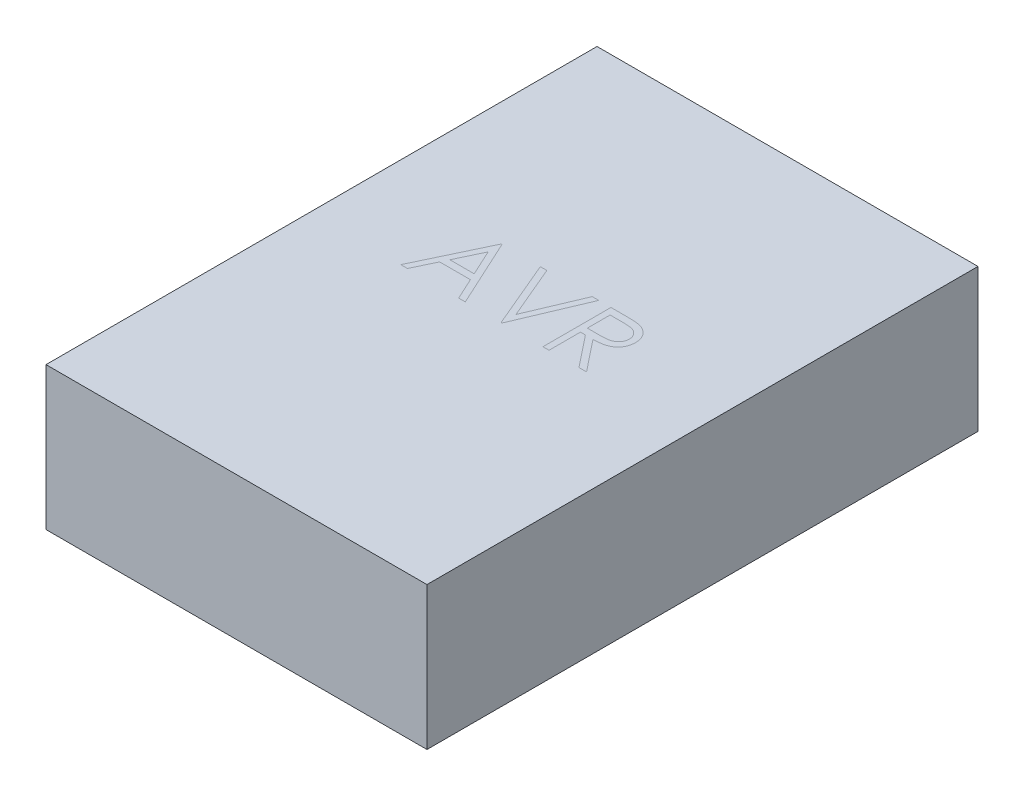
ISO-10303-21;
HEADER;
FILE_DESCRIPTION(('STEP AP214'),'2;1');
FILE_NAME('part.step','',(''),(''),'','','');
FILE_SCHEMA(('AUTOMOTIVE_DESIGN { 1 0 10303 214 1 1 1 1 }'));
ENDSEC;
DATA;
#1=APPLICATION_CONTEXT('core data for automotive mechanical design processes');
#2=APPLICATION_PROTOCOL_DEFINITION('international standard','automotive_design',2000,#1);
#3=PRODUCT_CONTEXT('',#1,'mechanical');
#4=PRODUCT('Part','Part','',(#3));
#5=PRODUCT_RELATED_PRODUCT_CATEGORY('part','',(#4));
#6=PRODUCT_DEFINITION_FORMATION('','',#4);
#7=PRODUCT_DEFINITION_CONTEXT('part definition',#1,'design');
#8=PRODUCT_DEFINITION('design','',#6,#7);
#9=PRODUCT_DEFINITION_SHAPE('','',#8);
#10=(LENGTH_UNIT() NAMED_UNIT(*) SI_UNIT(.MILLI.,.METRE.));
#11=(NAMED_UNIT(*) PLANE_ANGLE_UNIT() SI_UNIT($,.RADIAN.));
#12=(NAMED_UNIT(*) SI_UNIT($,.STERADIAN.) SOLID_ANGLE_UNIT());
#13=UNCERTAINTY_MEASURE_WITH_UNIT(LENGTH_MEASURE(1.E-05),#10,'distance_accuracy_value','');
#14=(GEOMETRIC_REPRESENTATION_CONTEXT(3) GLOBAL_UNCERTAINTY_ASSIGNED_CONTEXT((#13)) GLOBAL_UNIT_ASSIGNED_CONTEXT((#10,
#11,#12)) REPRESENTATION_CONTEXT('',''));
#15=CARTESIAN_POINT('',(0.,0.,0.));
#16=DIRECTION('',(0.,0.,1.));
#17=DIRECTION('',(1.,0.,0.));
#18=AXIS2_PLACEMENT_3D('',#15,#16,#17);
#19=CARTESIAN_POINT('',(0.,105.,0.));
#20=DIRECTION('',(0.,1.,0.));
#21=DIRECTION('',(0.,0.,1.));
#22=AXIS2_PLACEMENT_3D('',#19,#20,#21);
#23=PLANE('',#22);
#24=DIRECTION('',(-1.,0.,0.));
#25=VECTOR('',#24,1.);
#26=CARTESIAN_POINT('',(0.,105.,-41.5071527558936));
#27=LINE('',#26,#25);
#28=CARTESIAN_POINT('',(41.2358151045253,105.,-41.5071527558936));
#29=VERTEX_POINT('',#28);
#30=CARTESIAN_POINT('',(31.2298054891407,105.,-41.5071527558936));
#31=VERTEX_POINT('',#30);
#32=EDGE_CURVE('E321',#29,#31,#27,.T.);
#33=ORIENTED_EDGE('',*,*,#32,.T.);
#34=DIRECTION('',(0.,0.,1.));
#35=VECTOR('',#34,1.);
#36=CARTESIAN_POINT('',(31.2298054891407,105.,0.));
#37=LINE('',#36,#35);
#38=CARTESIAN_POINT('',(31.2298054891407,105.,8.49284724410642));
#39=VERTEX_POINT('',#38);
#40=EDGE_CURVE('E328',#31,#39,#37,.T.);
#41=ORIENTED_EDGE('',*,*,#40,.T.);
#42=DIRECTION('',(1.,0.,0.));
#43=VECTOR('',#42,1.);
#44=CARTESIAN_POINT('',(0.,105.,8.49284724410642));
#45=LINE('',#44,#43);
#46=CARTESIAN_POINT('',(35.7169849763202,105.,8.49284724410642));
#47=VERTEX_POINT('',#46);
#48=EDGE_CURVE('E273',#39,#47,#45,.T.);
#49=ORIENTED_EDGE('',*,*,#48,.T.);
#50=DIRECTION('',(0.,0.,-1.));
#51=VECTOR('',#50,1.);
#52=CARTESIAN_POINT('',(35.7169849763202,105.,0.));
#53=LINE('',#52,#51);
#54=CARTESIAN_POINT('',(35.7169849763202,105.,-14.5840758328167));
#55=VERTEX_POINT('',#54);
#56=EDGE_CURVE('E277',#47,#55,#53,.T.);
#57=ORIENTED_EDGE('',*,*,#56,.T.);
#58=DIRECTION('',(1.,0.,0.));
#59=VECTOR('',#58,1.);
#60=CARTESIAN_POINT('',(0.,105.,-14.5840758328167));
#61=LINE('',#60,#59);
#62=CARTESIAN_POINT('',(39.3628183096535,105.,-14.5840758328167));
#63=VERTEX_POINT('',#62);
#64=EDGE_CURVE('E281',#55,#63,#61,.T.);
#65=ORIENTED_EDGE('',*,*,#64,.T.);
#66=DIRECTION('',(0.622788232243938,0.,0.782390450976027));
#67=VECTOR('',#66,1.);
#68=CARTESIAN_POINT('',(31.2016404087046,105.,-24.8367224433872));
#69=LINE('',#68,#67);
#70=CARTESIAN_POINT('',(57.7322093352946,105.,8.49284724410642));
#71=VERTEX_POINT('',#70);
#72=EDGE_CURVE('E285',#63,#71,#69,.T.);
#73=ORIENTED_EDGE('',*,*,#72,.T.);
#74=DIRECTION('',(1.,0.,0.));
#75=VECTOR('',#74,1.);
#76=CARTESIAN_POINT('',(0.,105.,8.49284724410642));
#77=LINE('',#76,#75);
#78=CARTESIAN_POINT('',(63.2810875404228,105.,8.49284724410642));
#79=VERTEX_POINT('',#78);
#80=EDGE_CURVE('E289',#71,#79,#77,.T.);
#81=ORIENTED_EDGE('',*,*,#80,.T.);
#82=DIRECTION('',(-0.622788232243938,0.,-0.782390450976027));
#83=VECTOR('',#82,1.);
#84=CARTESIAN_POINT('',(34.5983019576757,105.,-27.5404886242956));
#85=LINE('',#84,#83);
#86=CARTESIAN_POINT('',(44.9116965147818,105.,-14.5840758328167));
#87=VERTEX_POINT('',#86);
#88=EDGE_CURVE('E293',#79,#87,#85,.T.);
#89=ORIENTED_EDGE('',*,*,#88,.T.);
#90=CARTESIAN_POINT('',(62.6400618993972,105.,-28.1357585251244));
#91=CARTESIAN_POINT('',(62.6190762121329,105.,-27.469542744968));
#92=CARTESIAN_POINT('',(62.5781277008523,105.,-26.16958320371));
#93=CARTESIAN_POINT('',(62.1963405054234,105.,-24.2829991835847));
#94=CARTESIAN_POINT('',(61.5709616521555,105.,-22.5231518315783));
#95=CARTESIAN_POINT('',(60.7092003805939,105.,-20.8922570042145));
#96=CARTESIAN_POINT('',(59.6117792989727,105.,-19.4221049276412));
#97=CARTESIAN_POINT('',(58.2928537117819,105.,-18.1308127090144));
#98=CARTESIAN_POINT('',(56.751687833358,105.,-17.0502425291456));
#99=CARTESIAN_POINT('',(55.3169833199411,105.,-16.3009167476955));
#100=CARTESIAN_POINT('',(54.0496376099892,105.,-15.8210180530562));
#101=CARTESIAN_POINT('',(53.0063045701602,105.,-15.4833557836413));
#102=CARTESIAN_POINT('',(51.8682048916484,105.,-15.2224705653973));
#103=CARTESIAN_POINT('',(50.6462429687073,105.,-14.9887543972461));
#104=CARTESIAN_POINT('',(49.3353336045344,105.,-14.8123016199386));
#105=CARTESIAN_POINT('',(47.9386187561172,105.,-14.6830645560907));
#106=CARTESIAN_POINT('',(46.4551023042588,105.,-14.6022924318295));
#107=CARTESIAN_POINT('',(45.4359727420711,105.,-14.590263790559));
#108=CARTESIAN_POINT('',(44.9116965147817,105.,-14.5840758328167));
#109=B_SPLINE_CURVE_WITH_KNOTS('',3,(#90,#91,#92,#93,#94,#95,#96,#97,#98,#99,#100,#101,#102,
#103,#104,#105,#106,#107,#108),.UNSPECIFIED.,.F.,.F.,(4,1,1,1,1,1,1,1,1,1,1,1,1,1,1,1,4),(0.,
0.0787802355821393,0.153720644208585,0.226713530308781,0.299191166065937,0.371189996837668,
0.44300641435341,0.516689173294881,0.593217216623412,0.633872917807845,0.67698914228998,
0.722899506325827,0.771958610506145,0.824211323334835,0.879378650627203,0.937948119330418,1.),.UNSPECIFIED.);
#110=CARTESIAN_POINT('',(62.6400618993972,105.,-28.1357585251244));
#111=VERTEX_POINT('',#110);
#112=EDGE_CURVE('E297',#87,#111,#109,.F.);
#113=ORIENTED_EDGE('',*,*,#112,.T.);
#114=CARTESIAN_POINT('',(52.5639401045253,105.,-40.8260630123038));
#115=CARTESIAN_POINT('',(52.9297490207659,105.,-40.7356806499386));
#116=CARTESIAN_POINT('',(53.6535631560764,105.,-40.5568440263399));
#117=CARTESIAN_POINT('',(54.6957069566463,105.,-40.1788497288592));
#118=CARTESIAN_POINT('',(55.6887687273854,105.,-39.7414265199349));
#119=CARTESIAN_POINT('',(56.6286233605528,105.,-39.2276590868195));
#120=CARTESIAN_POINT('',(57.5105632347016,105.,-38.6337336629263));
#121=CARTESIAN_POINT('',(58.3436819603397,105.,-37.9699033424242));
#122=CARTESIAN_POINT('',(59.131760008625,105.,-37.239800402846));
#123=CARTESIAN_POINT('',(59.8429261540587,105.,-36.425016952808));
#124=CARTESIAN_POINT('',(60.5134840354094,105.,-35.5702096716652));
#125=CARTESIAN_POINT('',(61.0790358425606,105.,-34.6458702882198));
#126=CARTESIAN_POINT('',(61.5665569814533,105.,-33.6792770378767));
#127=CARTESIAN_POINT('',(61.9547072243125,105.,-32.6605996413698));
#128=CARTESIAN_POINT('',(62.2672497025004,105.,-31.5997171861895));
#129=CARTESIAN_POINT('',(62.4876245506569,105.,-30.4870200900866));
#130=CARTESIAN_POINT('',(62.6197843739541,105.,-29.3275775888878));
#131=CARTESIAN_POINT('',(62.6332394532901,105.,-28.5367503204362));
#132=CARTESIAN_POINT('',(62.6400618993971,105.,-28.1357585251244));
#133=B_SPLINE_CURVE_WITH_KNOTS('',3,(#114,#115,#116,#117,#118,#119,#120,#121,#122,#123,#124,
#125,#126,#127,#128,#129,#130,#131,#132),.UNSPECIFIED.,.F.,.F.,(4,1,1,1,1,1,1,1,1,1,1,1,1,1,1,1,
4),(0.,0.06421684263143,0.127063765693128,0.188744538347829,0.249132102835042,0.309452532710628,
0.369826676247682,0.430650141838468,0.492351931879469,0.554072106262517,0.615689783744975,
0.676797702506538,0.738439048246942,0.801316910064893,0.865184511711541,0.931641324419076,1.),.UNSPECIFIED.);
#134=CARTESIAN_POINT('',(52.5639401045253,105.,-40.8260630123038));
#135=VERTEX_POINT('',#134);
#136=EDGE_CURVE('E303',#111,#135,#133,.F.);
#137=ORIENTED_EDGE('',*,*,#136,.T.);
#138=CARTESIAN_POINT('',(41.2358151045253,105.,-41.5071527558936));
#139=CARTESIAN_POINT('',(41.9035455118622,105.,-41.5049300989216));
#140=CARTESIAN_POINT('',(43.1856618605631,105.,-41.5006623513248));
#141=CARTESIAN_POINT('',(45.0224228657008,105.,-41.4768657383513));
#142=CARTESIAN_POINT('',(46.6913813942749,105.,-41.4086606568051));
#143=CARTESIAN_POINT('',(48.1916648130912,105.,-41.349966607132));
#144=CARTESIAN_POINT('',(49.523245598467,105.,-41.2429388739442));
#145=CARTESIAN_POINT('',(50.6902068948663,105.,-41.1406439150898));
#146=CARTESIAN_POINT('',(51.6871740020264,105.,-41.0067344753906));
#147=CARTESIAN_POINT('',(52.2906861634918,105.,-40.8823712901673));
#148=CARTESIAN_POINT('',(52.5639401045253,105.,-40.8260630123038));
#149=B_SPLINE_CURVE_WITH_KNOTS('',3,(#138,#139,#140,#141,#142,#143,#144,#145,#146,#147,#148),
.UNSPECIFIED.,.F.,.F.,(4,1,1,1,1,1,1,1,4),(0.,0.176257754817801,0.338434413880475,
0.484822050787837,0.617157578266332,0.734698360612476,0.83738518383236,0.926372420929583,1.),.UNSPECIFIED.);
#150=EDGE_CURVE('E312',#135,#29,#149,.F.);
#151=ORIENTED_EDGE('',*,*,#150,.T.);
#152=EDGE_LOOP('',(#33,#41,#49,#57,#65,#73,#81,#89,#113,#137,#151));
#153=FACE_BOUND('',#152,.T.);
#154=DIRECTION('',(0.,0.,-1.));
#155=VECTOR('',#154,1.);
#156=CARTESIAN_POINT('',(35.7169849763202,105.,0.));
#157=LINE('',#156,#155);
#158=CARTESIAN_POINT('',(35.7169849763202,105.,-19.7122809610218));
#159=VERTEX_POINT('',#158);
#160=CARTESIAN_POINT('',(35.7169849763202,105.,-36.3789476276885));
#161=VERTEX_POINT('',#160);
#162=EDGE_CURVE('E45',#159,#161,#157,.T.);
#163=ORIENTED_EDGE('',*,*,#162,.T.);
#164=DIRECTION('',(1.,0.,0.));
#165=VECTOR('',#164,1.);
#166=CARTESIAN_POINT('',(0.,105.,-36.3789476276885));
#167=LINE('',#166,#165);
#168=CARTESIAN_POINT('',(45.0919849763202,105.,-36.3789476276885));
#169=VERTEX_POINT('',#168);
#170=EDGE_CURVE('E11',#161,#169,#167,.T.);
#171=ORIENTED_EDGE('',*,*,#170,.T.);
#172=CARTESIAN_POINT('',(58.1528824122176,105.,-28.1457745507654));
#173=CARTESIAN_POINT('',(58.1357092538106,105.,-28.5478684611895));
#174=CARTESIAN_POINT('',(58.1016783201925,105.,-29.3446718708834));
#175=CARTESIAN_POINT('',(57.8238387698108,105.,-30.5111848749922));
#176=CARTESIAN_POINT('',(57.3539904647186,105.,-31.6121413054318));
#177=CARTESIAN_POINT('',(56.7208156372218,105.,-32.643062519599));
#178=CARTESIAN_POINT('',(55.9493991377572,105.,-33.5788587460902));
#179=CARTESIAN_POINT('',(55.0448589564054,105.,-34.3795323611977));
#180=CARTESIAN_POINT('',(54.0319275971186,105.,-35.0402389994562));
#181=CARTESIAN_POINT('',(53.0851961920918,105.,-35.46244443534));
#182=CARTESIAN_POINT('',(52.2389931564861,105.,-35.7212994817104));
#183=CARTESIAN_POINT('',(51.5042837273302,105.,-35.9034589647253));
#184=CARTESIAN_POINT('',(50.6741197599105,105.,-36.0498085208673));
#185=CARTESIAN_POINT('',(49.7444703511685,105.,-36.1670665333704));
#186=CARTESIAN_POINT('',(48.7193041970989,105.,-36.2678514512103));
#187=CARTESIAN_POINT('',(47.5934377529344,105.,-36.3357340034692));
#188=CARTESIAN_POINT('',(46.3743408920589,105.,-36.3759320621265));
#189=CARTESIAN_POINT('',(45.5293847321814,105.,-36.3779190461345));
#190=CARTESIAN_POINT('',(45.0919849763202,105.,-36.3789476276885));
#191=B_SPLINE_CURVE_WITH_KNOTS('',3,(#172,#173,#174,#175,#176,#177,#178,#179,#180,#181,#182,
#183,#184,#185,#186,#187,#188,#189,#190),.UNSPECIFIED.,.F.,.F.,(4,1,1,1,1,1,1,1,1,1,1,1,1,1,1,1,
4),(0.,0.068814295824309,0.136364824552215,0.204019353511246,0.273063738624611,0.34291331956149,
0.410965444138957,0.479168766513446,0.549308006509783,0.58765157641765,0.63064666876279,
0.678878785696649,0.731934299229583,0.791111422948047,0.855283189513077,0.925085938677385,1.),.UNSPECIFIED.);
#192=CARTESIAN_POINT('',(58.1528824122176,105.,-28.1457745507654));
#193=VERTEX_POINT('',#192);
#194=EDGE_CURVE('E331',#169,#193,#191,.F.);
#195=ORIENTED_EDGE('',*,*,#194,.T.);
#196=CARTESIAN_POINT('',(44.8716324122176,105.,-19.6421687815346));
#197=CARTESIAN_POINT('',(45.2990615396727,105.,-19.6419796864752));
#198=CARTESIAN_POINT('',(46.1275409270928,105.,-19.6416131663929));
#199=CARTESIAN_POINT('',(47.3261218529697,105.,-19.6986671127294));
#200=CARTESIAN_POINT('',(48.4421234485639,105.,-19.7635716590576));
#201=CARTESIAN_POINT('',(49.4712770508842,105.,-19.8628480238682));
#202=CARTESIAN_POINT('',(50.4140424126837,105.,-19.9907919056648));
#203=CARTESIAN_POINT('',(51.2699483158494,105.,-20.1508345376451));
#204=CARTESIAN_POINT('',(52.0403919143743,105.,-20.3372925754578));
#205=CARTESIAN_POINT('',(52.93894246327,105.,-20.6258872298861));
#206=CARTESIAN_POINT('',(53.9423214826546,105.,-21.0831160622469));
#207=CARTESIAN_POINT('',(55.0327709094698,105.,-21.7483374721689));
#208=CARTESIAN_POINT('',(55.9613757344774,105.,-22.5850391745616));
#209=CARTESIAN_POINT('',(56.7459166245482,105.,-23.541802832196));
#210=CARTESIAN_POINT('',(57.3763370741956,105.,-24.5937492441627));
#211=CARTESIAN_POINT('',(57.8207949932604,105.,-25.728268804394));
#212=CARTESIAN_POINT('',(58.1028298831473,105.,-26.9167202045027));
#213=CARTESIAN_POINT('',(58.1360948181391,105.,-27.7335503165704));
#214=CARTESIAN_POINT('',(58.1528824122176,105.,-28.1457745507654));
#215=B_SPLINE_CURVE_WITH_KNOTS('',3,(#196,#197,#198,#199,#200,#201,#202,#203,#204,#205,#206,
#207,#208,#209,#210,#211,#212,#213,#214),.UNSPECIFIED.,.F.,.F.,(4,1,1,1,1,1,1,1,1,1,1,1,1,1,1,1,
4),(0.,0.0716681496796049,0.138913286274205,0.201184570026559,0.259124428290545,
0.312255041426236,0.36068150962311,0.405086143328644,0.44510165859071,0.51877778048826,
0.589461579033196,0.658462241985717,0.727283218368366,0.796322486904719,0.863174893207881,
0.930949380987856,1.),.UNSPECIFIED.);
#216=CARTESIAN_POINT('',(44.8716324122176,105.,-19.6421687815346));
#217=VERTEX_POINT('',#216);
#218=EDGE_CURVE('E337',#193,#217,#215,.F.);
#219=ORIENTED_EDGE('',*,*,#218,.T.);
#220=DIRECTION('',(-0.999970673881285,0.,-0.00765841872775599));
#221=VECTOR('',#220,1.);
#222=CARTESIAN_POINT('',(0.153055324829829,105.,-19.9846524134949));
#223=LINE('',#222,#221);
#224=EDGE_CURVE('E346',#217,#159,#223,.T.);
#225=ORIENTED_EDGE('',*,*,#224,.T.);
#226=EDGE_LOOP('',(#163,#171,#195,#219,#225));
#227=FACE_BOUND('',#226,.T.);
#228=ADVANCED_FACE('F36',(#153,#227),#23,.T.);
#229=ORIENTED_EDGE('',*,*,#170,.F.);
#230=ORIENTED_EDGE('',*,*,#162,.F.);
#231=ORIENTED_EDGE('',*,*,#224,.F.);
#232=ORIENTED_EDGE('',*,*,#218,.F.);
#233=ORIENTED_EDGE('',*,*,#194,.F.);
#234=EDGE_LOOP('',(#229,#230,#231,#232,#233));
#235=FACE_BOUND('',#234,.T.);
#236=ADVANCED_FACE('F355',(#235),#23,.T.);
#237=DIRECTION('',(-1.,0.,0.));
#238=VECTOR('',#237,1.);
#239=CARTESIAN_POINT('',(0.,105.,-41.5071527558936));
#240=LINE('',#239,#238);
#241=CARTESIAN_POINT('',(-15.8855791262439,105.,-41.5071527558936));
#242=VERTEX_POINT('',#241);
#243=CARTESIAN_POINT('',(-20.6932714339362,105.,-41.5071527558936));
#244=VERTEX_POINT('',#243);
#245=EDGE_CURVE('E266',#242,#244,#240,.T.);
#246=ORIENTED_EDGE('',*,*,#245,.T.);
#247=DIRECTION('',(0.389639990836698,0.,0.920967251068559));
#248=VECTOR('',#247,1.);
#249=CARTESIAN_POINT('',(-2.65697089229022,105.,1.12410306981509));
#250=LINE('',#249,#248);
#251=CARTESIAN_POINT('',(0.460574719909956,105.,8.49284724410642));
#252=VERTEX_POINT('',#251);
#253=EDGE_CURVE('E270',#244,#252,#250,.T.);
#254=ORIENTED_EDGE('',*,*,#253,.T.);
#255=DIRECTION('',(1.,0.,0.));
#256=VECTOR('',#255,1.);
#257=CARTESIAN_POINT('',(0.,105.,8.49284724410642));
#258=LINE('',#257,#256);
#259=CARTESIAN_POINT('',(1.1016003609356,105.,8.49284724410642));
#260=VERTEX_POINT('',#259);
#261=EDGE_CURVE('E246',#252,#260,#258,.T.);
#262=ORIENTED_EDGE('',*,*,#261,.T.);
#263=DIRECTION('',(0.389639990836698,0.,-0.920967251068559));
#264=VECTOR('',#263,1.);
#265=CARTESIAN_POINT('',(3.98197761079912,105.,1.68468283533809));
#266=LINE('',#265,#264);
#267=CARTESIAN_POINT('',(22.2554465147817,105.,-41.5071527558936));
#268=VERTEX_POINT('',#267);
#269=EDGE_CURVE('E250',#260,#268,#266,.T.);
#270=ORIENTED_EDGE('',*,*,#269,.T.);
#271=DIRECTION('',(-1.,0.,0.));
#272=VECTOR('',#271,1.);
#273=CARTESIAN_POINT('',(0.,105.,-41.5071527558936));
#274=LINE('',#273,#272);
#275=CARTESIAN_POINT('',(17.4377381814484,105.,-41.5071527558936));
#276=VERTEX_POINT('',#275);
#277=EDGE_CURVE('E254',#268,#276,#274,.T.);
#278=ORIENTED_EDGE('',*,*,#277,.T.);
#279=DIRECTION('',(-0.389815755430441,0.,0.920892869349196));
#280=VECTOR('',#279,1.);
#281=CARTESIAN_POINT('',(-0.112213888885631,105.,-0.0475003589686313));
#282=LINE('',#281,#280);
#283=CARTESIAN_POINT('',(0.771071514781743,105.,-2.13415596102179));
#284=VERTEX_POINT('',#283);
#285=EDGE_CURVE('E258',#276,#284,#282,.T.);
#286=ORIENTED_EDGE('',*,*,#285,.T.);
#287=DIRECTION('',(-0.389617061880413,0.,-0.920976951444321));
#288=VECTOR('',#287,1.);
#289=CARTESIAN_POINT('',(1.41981736473583,105.,-0.600650286836858));
#290=LINE('',#289,#288);
#291=EDGE_CURVE('E262',#284,#242,#290,.T.);
#292=ORIENTED_EDGE('',*,*,#291,.T.);
#293=EDGE_LOOP('',(#246,#254,#262,#270,#278,#286,#292));
#294=FACE_BOUND('',#293,.T.);
#295=ADVANCED_FACE('F357',(#294),#23,.T.);
#296=DIRECTION('',(-0.419058177461747,0.,-0.907959384500452));
#297=VECTOR('',#296,1.);
#298=CARTESIAN_POINT('',(-24.5183981660594,105.,11.3161837689505));
#299=LINE('',#298,#297);
#300=CARTESIAN_POINT('',(-25.8214765621413,105.,8.49284724410642));
#301=VERTEX_POINT('',#300);
#302=CARTESIAN_POINT('',(-48.8983996390644,105.,-41.5071527558936));
#303=VERTEX_POINT('',#302);
#304=EDGE_CURVE('E228',#301,#303,#299,.T.);
#305=ORIENTED_EDGE('',*,*,#304,.T.);
#306=DIRECTION('',(-1.,0.,0.));
#307=VECTOR('',#306,1.);
#308=CARTESIAN_POINT('',(0.,105.,-41.5071527558936));
#309=LINE('',#308,#307);
#310=CARTESIAN_POINT('',(-49.53942528009,105.,-41.5071527558936));
#311=VERTEX_POINT('',#310);
#312=EDGE_CURVE('E232',#303,#311,#309,.T.);
#313=ORIENTED_EDGE('',*,*,#312,.T.);
#314=DIRECTION('',(-0.428584206872173,0.,0.903501841514311));
#315=VECTOR('',#314,1.);
#316=CARTESIAN_POINT('',(-56.5124790363044,105.,-26.8072015941444));
#317=LINE('',#316,#315);
#318=CARTESIAN_POINT('',(-73.2573739980387,105.,8.49284724410642));
#319=VERTEX_POINT('',#318);
#320=EDGE_CURVE('E199',#311,#319,#317,.T.);
#321=ORIENTED_EDGE('',*,*,#320,.T.);
#322=DIRECTION('',(1.,0.,0.));
#323=VECTOR('',#322,1.);
#324=CARTESIAN_POINT('',(0.,105.,8.49284724410642));
#325=LINE('',#324,#323);
#326=CARTESIAN_POINT('',(-68.3495214339362,105.,8.49284724410642));
#327=VERTEX_POINT('',#326);
#328=EDGE_CURVE('E203',#319,#327,#325,.T.);
#329=ORIENTED_EDGE('',*,*,#328,.T.);
#330=DIRECTION('',(0.428134903458979,0.,-0.903714835797317));
#331=VECTOR('',#330,1.);
#332=CARTESIAN_POINT('',(-52.5351052756378,105.,-24.8885061243334));
#333=LINE('',#332,#331);
#334=CARTESIAN_POINT('',(-60.7573739980388,105.,-7.5327937815346));
#335=VERTEX_POINT('',#334);
#336=EDGE_CURVE('E212',#327,#335,#333,.T.);
#337=ORIENTED_EDGE('',*,*,#336,.T.);
#338=DIRECTION('',(1.,0.,0.));
#339=VECTOR('',#338,1.);
#340=CARTESIAN_POINT('',(0.,105.,-7.5327937815346));
#341=LINE('',#340,#339);
#342=CARTESIAN_POINT('',(-38.0911079723977,105.,-7.5327937815346));
#343=VERTEX_POINT('',#342);
#344=EDGE_CURVE('E216',#335,#343,#341,.T.);
#345=ORIENTED_EDGE('',*,*,#344,.T.);
#346=DIRECTION('',(0.418842224744609,0.,0.908059023836549));
#347=VECTOR('',#346,1.);
#348=CARTESIAN_POINT('',(-28.5438567230582,105.,13.1658539135106));
#349=LINE('',#348,#347);
#350=CARTESIAN_POINT('',(-30.6992810493208,105.,8.49284724410642));
#351=VERTEX_POINT('',#350);
#352=EDGE_CURVE('E220',#343,#351,#349,.T.);
#353=ORIENTED_EDGE('',*,*,#352,.T.);
#354=DIRECTION('',(1.,0.,0.));
#355=VECTOR('',#354,1.);
#356=CARTESIAN_POINT('',(0.,105.,8.49284724410642));
#357=LINE('',#356,#355);
#358=EDGE_CURVE('E224',#351,#301,#357,.T.);
#359=ORIENTED_EDGE('',*,*,#358,.T.);
#360=EDGE_LOOP('',(#305,#313,#321,#329,#337,#345,#353,#359));
#361=FACE_BOUND('',#360,.T.);
#362=DIRECTION('',(0.428147488377339,0.,-0.903708873584948));
#363=VECTOR('',#362,1.);
#364=CARTESIAN_POINT('',(-52.5228092173017,105.,-24.8835764549965));
#365=LINE('',#364,#363);
#366=CARTESIAN_POINT('',(-58.3134637416285,105.,-12.6609989097397));
#367=VERTEX_POINT('',#366);
#368=CARTESIAN_POINT('',(-49.2689925877824,105.,-31.7515437815346));
#369=VERTEX_POINT('',#368);
#370=EDGE_CURVE('E239',#367,#369,#365,.T.);
#371=ORIENTED_EDGE('',*,*,#370,.T.);
#372=DIRECTION('',(0.419179001401218,0.,0.907903609853093));
#373=VECTOR('',#372,1.);
#374=CARTESIAN_POINT('',(-28.5280707914749,105.,13.1714072909223));
#375=LINE('',#374,#373);
#376=CARTESIAN_POINT('',(-40.4548900236798,105.,-12.6609989097397));
#377=VERTEX_POINT('',#376);
#378=EDGE_CURVE('E243',#369,#377,#375,.T.);
#379=ORIENTED_EDGE('',*,*,#378,.T.);
#380=DIRECTION('',(-1.,0.,0.));
#381=VECTOR('',#380,1.);
#382=CARTESIAN_POINT('',(0.,105.,-12.6609989097397));
#383=LINE('',#382,#381);
#384=EDGE_CURVE('E235',#377,#367,#383,.T.);
#385=ORIENTED_EDGE('',*,*,#384,.T.);
#386=EDGE_LOOP('',(#371,#379,#385));
#387=FACE_BOUND('',#386,.T.);
#388=ADVANCED_FACE('F363',(#361,#387),#23,.T.);
#389=ORIENTED_EDGE('',*,*,#378,.F.);
#390=ORIENTED_EDGE('',*,*,#370,.F.);
#391=ORIENTED_EDGE('',*,*,#384,.F.);
#392=EDGE_LOOP('',(#389,#390,#391));
#393=FACE_BOUND('',#392,.T.);
#394=ADVANCED_FACE('F371',(#393),#23,.T.);
#395=CARTESIAN_POINT('',(140.,105.,-202.5));
#396=DIRECTION('',(-1.,0.,0.));
#397=DIRECTION('',(0.,0.,1.));
#398=AXIS2_PLACEMENT_3D('',#395,#396,#397);
#399=PLANE('',#398);
#400=DIRECTION('',(0.,0.,-1.));
#401=VECTOR('',#400,1.);
#402=CARTESIAN_POINT('',(140.,0.,-202.5));
#403=LINE('',#402,#401);
#404=CARTESIAN_POINT('',(140.,0.,202.5));
#405=VERTEX_POINT('',#404);
#406=CARTESIAN_POINT('',(140.,0.,-202.5));
#407=VERTEX_POINT('',#406);
#408=EDGE_CURVE('E198',#405,#407,#403,.T.);
#409=ORIENTED_EDGE('',*,*,#408,.T.);
#410=DIRECTION('',(0.,-1.,0.));
#411=VECTOR('',#410,1.);
#412=CARTESIAN_POINT('',(140.,105.,-202.5));
#413=LINE('',#412,#411);
#414=CARTESIAN_POINT('',(140.,105.,-202.5));
#415=VERTEX_POINT('',#414);
#416=EDGE_CURVE('E179',#415,#407,#413,.T.);
#417=ORIENTED_EDGE('',*,*,#416,.F.);
#418=DIRECTION('',(0.,0.,-1.));
#419=VECTOR('',#418,1.);
#420=CARTESIAN_POINT('',(140.,105.,-202.5));
#421=LINE('',#420,#419);
#422=CARTESIAN_POINT('',(140.,105.,202.5));
#423=VERTEX_POINT('',#422);
#424=EDGE_CURVE('E186',#423,#415,#421,.T.);
#425=ORIENTED_EDGE('',*,*,#424,.F.);
#426=DIRECTION('',(0.,-1.,0.));
#427=VECTOR('',#426,1.);
#428=CARTESIAN_POINT('',(140.,105.,202.5));
#429=LINE('',#428,#427);
#430=EDGE_CURVE('E477',#423,#405,#429,.T.);
#431=ORIENTED_EDGE('',*,*,#430,.T.);
#432=EDGE_LOOP('',(#409,#417,#425,#431));
#433=FACE_BOUND('',#432,.T.);
#434=ADVANCED_FACE('F38',(#433),#399,.F.);
#435=CARTESIAN_POINT('',(-140.,105.,-202.5));
#436=DIRECTION('',(0.,0.,1.));
#437=DIRECTION('',(1.,0.,0.));
#438=AXIS2_PLACEMENT_3D('',#435,#436,#437);
#439=PLANE('',#438);
#440=DIRECTION('',(-1.,0.,0.));
#441=VECTOR('',#440,1.);
#442=CARTESIAN_POINT('',(-140.,0.,-202.5));
#443=LINE('',#442,#441);
#444=CARTESIAN_POINT('',(-140.,0.,-202.5));
#445=VERTEX_POINT('',#444);
#446=EDGE_CURVE('E475',#407,#445,#443,.T.);
#447=ORIENTED_EDGE('',*,*,#446,.T.);
#448=DIRECTION('',(0.,-1.,0.));
#449=VECTOR('',#448,1.);
#450=CARTESIAN_POINT('',(-140.,105.,-202.5));
#451=LINE('',#450,#449);
#452=CARTESIAN_POINT('',(-140.,105.,-202.5));
#453=VERTEX_POINT('',#452);
#454=EDGE_CURVE('E182',#453,#445,#451,.T.);
#455=ORIENTED_EDGE('',*,*,#454,.F.);
#456=DIRECTION('',(-1.,0.,0.));
#457=VECTOR('',#456,1.);
#458=CARTESIAN_POINT('',(-140.,105.,-202.5));
#459=LINE('',#458,#457);
#460=EDGE_CURVE('E175',#415,#453,#459,.T.);
#461=ORIENTED_EDGE('',*,*,#460,.F.);
#462=ORIENTED_EDGE('',*,*,#416,.T.);
#463=EDGE_LOOP('',(#447,#455,#461,#462));
#464=FACE_BOUND('',#463,.T.);
#465=ADVANCED_FACE('F177',(#464),#439,.F.);
#466=CARTESIAN_POINT('',(-140.,105.,-202.5));
#467=DIRECTION('',(1.,0.,0.));
#468=DIRECTION('',(0.,0.,-1.));
#469=AXIS2_PLACEMENT_3D('',#466,#467,#468);
#470=PLANE('',#469);
#471=DIRECTION('',(0.,0.,1.));
#472=VECTOR('',#471,1.);
#473=CARTESIAN_POINT('',(-140.,0.,-202.5));
#474=LINE('',#473,#472);
#475=CARTESIAN_POINT('',(-140.,0.,202.5));
#476=VERTEX_POINT('',#475);
#477=EDGE_CURVE('E472',#445,#476,#474,.T.);
#478=ORIENTED_EDGE('',*,*,#477,.T.);
#479=DIRECTION('',(0.,-1.,0.));
#480=VECTOR('',#479,1.);
#481=CARTESIAN_POINT('',(-140.,105.,202.5));
#482=LINE('',#481,#480);
#483=CARTESIAN_POINT('',(-140.,105.,202.5));
#484=VERTEX_POINT('',#483);
#485=EDGE_CURVE('E205',#484,#476,#482,.T.);
#486=ORIENTED_EDGE('',*,*,#485,.F.);
#487=DIRECTION('',(0.,0.,1.));
#488=VECTOR('',#487,1.);
#489=CARTESIAN_POINT('',(-140.,105.,-202.5));
#490=LINE('',#489,#488);
#491=EDGE_CURVE('E185',#453,#484,#490,.T.);
#492=ORIENTED_EDGE('',*,*,#491,.F.);
#493=ORIENTED_EDGE('',*,*,#454,.T.);
#494=EDGE_LOOP('',(#478,#486,#492,#493));
#495=FACE_BOUND('',#494,.T.);
#496=ADVANCED_FACE('F377',(#495),#470,.F.);
#497=CARTESIAN_POINT('',(-140.,105.,202.5));
#498=DIRECTION('',(0.,0.,-1.));
#499=DIRECTION('',(-1.,0.,0.));
#500=AXIS2_PLACEMENT_3D('',#497,#498,#499);
#501=PLANE('',#500);
#502=DIRECTION('',(1.,0.,0.));
#503=VECTOR('',#502,1.);
#504=CARTESIAN_POINT('',(-140.,0.,202.5));
#505=LINE('',#504,#503);
#506=EDGE_CURVE('E195',#476,#405,#505,.T.);
#507=ORIENTED_EDGE('',*,*,#506,.T.);
#508=ORIENTED_EDGE('',*,*,#430,.F.);
#509=DIRECTION('',(1.,0.,0.));
#510=VECTOR('',#509,1.);
#511=CARTESIAN_POINT('',(-140.,105.,202.5));
#512=LINE('',#511,#510);
#513=EDGE_CURVE('E191',#484,#423,#512,.T.);
#514=ORIENTED_EDGE('',*,*,#513,.F.);
#515=ORIENTED_EDGE('',*,*,#485,.T.);
#516=EDGE_LOOP('',(#507,#508,#514,#515));
#517=FACE_BOUND('',#516,.T.);
#518=ADVANCED_FACE('F369',(#517),#501,.F.);
#519=ORIENTED_EDGE('',*,*,#40,.F.);
#520=ORIENTED_EDGE('',*,*,#32,.F.);
#521=ORIENTED_EDGE('',*,*,#150,.F.);
#522=ORIENTED_EDGE('',*,*,#136,.F.);
#523=ORIENTED_EDGE('',*,*,#112,.F.);
#524=ORIENTED_EDGE('',*,*,#88,.F.);
#525=ORIENTED_EDGE('',*,*,#80,.F.);
#526=ORIENTED_EDGE('',*,*,#72,.F.);
#527=ORIENTED_EDGE('',*,*,#64,.F.);
#528=ORIENTED_EDGE('',*,*,#56,.F.);
#529=ORIENTED_EDGE('',*,*,#48,.F.);
#530=EDGE_LOOP('',(#519,#520,#521,#522,#523,#524,#525,#526,#527,#528,#529));
#531=FACE_BOUND('',#530,.T.);
#532=ORIENTED_EDGE('',*,*,#253,.F.);
#533=ORIENTED_EDGE('',*,*,#245,.F.);
#534=ORIENTED_EDGE('',*,*,#291,.F.);
#535=ORIENTED_EDGE('',*,*,#285,.F.);
#536=ORIENTED_EDGE('',*,*,#277,.F.);
#537=ORIENTED_EDGE('',*,*,#269,.F.);
#538=ORIENTED_EDGE('',*,*,#261,.F.);
#539=EDGE_LOOP('',(#532,#533,#534,#535,#536,#537,#538));
#540=FACE_BOUND('',#539,.T.);
#541=ORIENTED_EDGE('',*,*,#312,.F.);
#542=ORIENTED_EDGE('',*,*,#304,.F.);
#543=ORIENTED_EDGE('',*,*,#358,.F.);
#544=ORIENTED_EDGE('',*,*,#352,.F.);
#545=ORIENTED_EDGE('',*,*,#344,.F.);
#546=ORIENTED_EDGE('',*,*,#336,.F.);
#547=ORIENTED_EDGE('',*,*,#328,.F.);
#548=ORIENTED_EDGE('',*,*,#320,.F.);
#549=EDGE_LOOP('',(#541,#542,#543,#544,#545,#546,#547,#548));
#550=FACE_BOUND('',#549,.T.);
#551=ORIENTED_EDGE('',*,*,#424,.T.);
#552=ORIENTED_EDGE('',*,*,#460,.T.);
#553=ORIENTED_EDGE('',*,*,#491,.T.);
#554=ORIENTED_EDGE('',*,*,#513,.T.);
#555=EDGE_LOOP('',(#551,#552,#553,#554));
#556=FACE_BOUND('',#555,.T.);
#557=ADVANCED_FACE('F189',(#531,#540,#550,#556),#23,.T.);
#558=CARTESIAN_POINT('',(0.,0.,0.));
#559=DIRECTION('',(0.,1.,0.));
#560=DIRECTION('',(0.,0.,1.));
#561=AXIS2_PLACEMENT_3D('',#558,#559,#560);
#562=PLANE('',#561);
#563=ORIENTED_EDGE('',*,*,#408,.F.);
#564=ORIENTED_EDGE('',*,*,#506,.F.);
#565=ORIENTED_EDGE('',*,*,#477,.F.);
#566=ORIENTED_EDGE('',*,*,#446,.F.);
#567=EDGE_LOOP('',(#563,#564,#565,#566));
#568=FACE_BOUND('',#567,.T.);
#569=ADVANCED_FACE('F368',(#568),#562,.F.);
#570=CLOSED_SHELL('',(#228,#236,#295,#388,#394,#434,#465,#496,#518,#557,#569));
#571=MANIFOLD_SOLID_BREP('B2',#570);
#572=ADVANCED_BREP_SHAPE_REPRESENTATION('',(#18,#571),#14);
#573=SHAPE_DEFINITION_REPRESENTATION(#9,#572);
ENDSEC;
END-ISO-10303-21;
